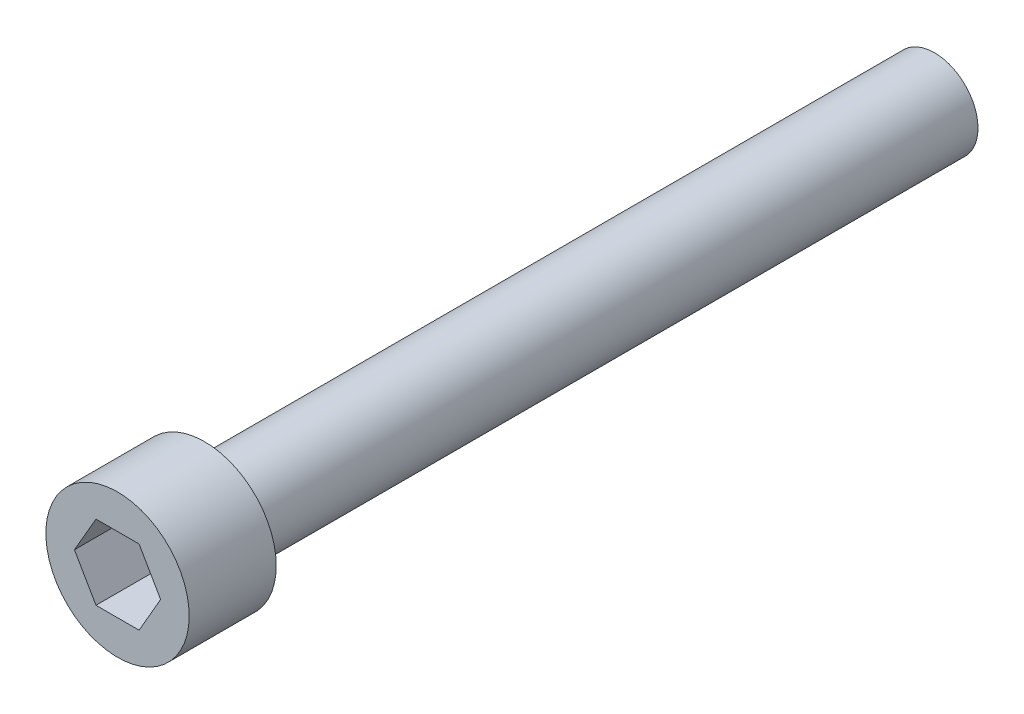
ISO-10303-21;
HEADER;
FILE_DESCRIPTION(('STEP AP214'),'2;1');
FILE_NAME('part.step','',(''),(''),'','','');
FILE_SCHEMA(('AUTOMOTIVE_DESIGN { 1 0 10303 214 1 1 1 1 }'));
ENDSEC;
DATA;
#1=APPLICATION_CONTEXT('core data for automotive mechanical design processes');
#2=APPLICATION_PROTOCOL_DEFINITION('international standard','automotive_design',2000,#1);
#3=PRODUCT_CONTEXT('',#1,'mechanical');
#4=PRODUCT('Part','Part','',(#3));
#5=PRODUCT_RELATED_PRODUCT_CATEGORY('part','',(#4));
#6=PRODUCT_DEFINITION_FORMATION('','',#4);
#7=PRODUCT_DEFINITION_CONTEXT('part definition',#1,'design');
#8=PRODUCT_DEFINITION('design','',#6,#7);
#9=PRODUCT_DEFINITION_SHAPE('','',#8);
#10=(LENGTH_UNIT() NAMED_UNIT(*) SI_UNIT(.MILLI.,.METRE.));
#11=(NAMED_UNIT(*) PLANE_ANGLE_UNIT() SI_UNIT($,.RADIAN.));
#12=(NAMED_UNIT(*) SI_UNIT($,.STERADIAN.) SOLID_ANGLE_UNIT());
#13=UNCERTAINTY_MEASURE_WITH_UNIT(LENGTH_MEASURE(1.E-05),#10,'distance_accuracy_value','');
#14=(GEOMETRIC_REPRESENTATION_CONTEXT(3) GLOBAL_UNCERTAINTY_ASSIGNED_CONTEXT((#13)) GLOBAL_UNIT_ASSIGNED_CONTEXT((#10,
#11,#12)) REPRESENTATION_CONTEXT('',''));
#15=CARTESIAN_POINT('',(0.,0.,0.));
#16=DIRECTION('',(0.,0.,1.));
#17=DIRECTION('',(1.,0.,0.));
#18=AXIS2_PLACEMENT_3D('',#15,#16,#17);
#19=CARTESIAN_POINT('',(3.42900000000001,0.,0.));
#20=DIRECTION('',(0.,0.,1.));
#21=DIRECTION('',(1.,0.,0.));
#22=AXIS2_PLACEMENT_3D('',#19,#20,#21);
#23=PLANE('',#22);
#24=DIRECTION('',(0.5,0.866025403784439,0.));
#25=VECTOR('',#24,1.);
#26=CARTESIAN_POINT('',(1.03111149638085,-1.7859375,0.));
#27=LINE('',#26,#25);
#28=CARTESIAN_POINT('',(1.03111149638085,-1.7859375,0.));
#29=VERTEX_POINT('',#28);
#30=CARTESIAN_POINT('',(2.06222299276169,0.,0.));
#31=VERTEX_POINT('',#30);
#32=EDGE_CURVE('E47',#29,#31,#27,.T.);
#33=ORIENTED_EDGE('',*,*,#32,.F.);
#34=DIRECTION('',(1.,0.,0.));
#35=VECTOR('',#34,1.);
#36=CARTESIAN_POINT('',(-1.03111149638085,-1.7859375,0.));
#37=LINE('',#36,#35);
#38=CARTESIAN_POINT('',(-1.03111149638085,-1.7859375,0.));
#39=VERTEX_POINT('',#38);
#40=EDGE_CURVE('E130',#39,#29,#37,.T.);
#41=ORIENTED_EDGE('',*,*,#40,.F.);
#42=DIRECTION('',(0.5,-0.866025403784439,0.));
#43=VECTOR('',#42,1.);
#44=CARTESIAN_POINT('',(-2.06222299276169,0.,0.));
#45=LINE('',#44,#43);
#46=CARTESIAN_POINT('',(-2.06222299276169,0.,0.));
#47=VERTEX_POINT('',#46);
#48=EDGE_CURVE('E128',#47,#39,#45,.T.);
#49=ORIENTED_EDGE('',*,*,#48,.F.);
#50=DIRECTION('',(-0.5,-0.866025403784439,0.));
#51=VECTOR('',#50,1.);
#52=CARTESIAN_POINT('',(-1.03111149638085,1.7859375,0.));
#53=LINE('',#52,#51);
#54=CARTESIAN_POINT('',(-1.03111149638085,1.7859375,0.));
#55=VERTEX_POINT('',#54);
#56=EDGE_CURVE('E95',#55,#47,#53,.T.);
#57=ORIENTED_EDGE('',*,*,#56,.F.);
#58=DIRECTION('',(-1.,0.,0.));
#59=VECTOR('',#58,1.);
#60=CARTESIAN_POINT('',(1.03111149638085,1.7859375,0.));
#61=LINE('',#60,#59);
#62=CARTESIAN_POINT('',(1.03111149638085,1.7859375,0.));
#63=VERTEX_POINT('',#62);
#64=EDGE_CURVE('E124',#63,#55,#61,.T.);
#65=ORIENTED_EDGE('',*,*,#64,.F.);
#66=DIRECTION('',(-0.5,0.866025403784438,0.));
#67=VECTOR('',#66,1.);
#68=CARTESIAN_POINT('',(2.06222299276169,0.,0.));
#69=LINE('',#68,#67);
#70=EDGE_CURVE('E121',#31,#63,#69,.T.);
#71=ORIENTED_EDGE('',*,*,#70,.F.);
#72=EDGE_LOOP('',(#33,#41,#49,#57,#65,#71));
#73=FACE_BOUND('',#72,.T.);
#74=CARTESIAN_POINT('',(0.,0.,0.));
#75=DIRECTION('',(0.,0.,1.));
#76=DIRECTION('',(1.,0.,0.));
#77=AXIS2_PLACEMENT_3D('',#74,#75,#76);
#78=CIRCLE('',#77,3.42900000000001);
#79=CARTESIAN_POINT('',(3.42900000000001,0.,0.));
#80=VERTEX_POINT('',#79);
#81=EDGE_CURVE('E134',#80,#80,#78,.T.);
#82=ORIENTED_EDGE('',*,*,#81,.T.);
#83=EDGE_LOOP('',(#82));
#84=FACE_BOUND('',#83,.T.);
#85=ADVANCED_FACE('F33',(#73,#84),#23,.T.);
#86=CARTESIAN_POINT('',(0.,0.,-39.0906));
#87=DIRECTION('',(0.,0.,-1.));
#88=DIRECTION('',(-1.,0.,0.));
#89=AXIS2_PLACEMENT_3D('',#86,#87,#88);
#90=PLANE('',#89);
#91=CARTESIAN_POINT('',(0.,0.,-39.0906));
#92=DIRECTION('',(0.,0.,1.));
#93=DIRECTION('',(1.,0.,0.));
#94=AXIS2_PLACEMENT_3D('',#91,#92,#93);
#95=CIRCLE('',#94,2.0828);
#96=CARTESIAN_POINT('',(2.08280000000001,0.,-39.0906));
#97=VERTEX_POINT('',#96);
#98=EDGE_CURVE('E11',#97,#97,#95,.T.);
#99=ORIENTED_EDGE('',*,*,#98,.F.);
#100=EDGE_LOOP('',(#99));
#101=FACE_BOUND('',#100,.T.);
#102=ADVANCED_FACE('F152',(#101),#90,.T.);
#103=CARTESIAN_POINT('',(0.,0.,0.));
#104=DIRECTION('',(0.,0.,1.));
#105=DIRECTION('',(1.,0.,0.));
#106=AXIS2_PLACEMENT_3D('',#103,#104,#105);
#107=CYLINDRICAL_SURFACE('',#106,2.0828);
#108=ORIENTED_EDGE('',*,*,#98,.T.);
#109=EDGE_LOOP('',(#108));
#110=FACE_BOUND('',#109,.T.);
#111=CARTESIAN_POINT('',(0.,0.,-4.1656));
#112=DIRECTION('',(0.,0.,1.));
#113=DIRECTION('',(1.,0.,0.));
#114=AXIS2_PLACEMENT_3D('',#111,#112,#113);
#115=CIRCLE('',#114,2.08280000000001);
#116=CARTESIAN_POINT('',(2.08280000000001,0.,-4.1656));
#117=VERTEX_POINT('',#116);
#118=EDGE_CURVE('E40',#117,#117,#115,.T.);
#119=ORIENTED_EDGE('',*,*,#118,.F.);
#120=EDGE_LOOP('',(#119));
#121=FACE_BOUND('',#120,.T.);
#122=ADVANCED_FACE('F150',(#110,#121),#107,.T.);
#123=CARTESIAN_POINT('',(2.08280000000001,0.,-4.1656));
#124=DIRECTION('',(0.,0.,-1.));
#125=DIRECTION('',(-1.,0.,0.));
#126=AXIS2_PLACEMENT_3D('',#123,#124,#125);
#127=PLANE('',#126);
#128=ORIENTED_EDGE('',*,*,#118,.T.);
#129=EDGE_LOOP('',(#128));
#130=FACE_BOUND('',#129,.T.);
#131=CARTESIAN_POINT('',(0.,0.,-4.1656));
#132=DIRECTION('',(0.,0.,1.));
#133=DIRECTION('',(1.,0.,0.));
#134=AXIS2_PLACEMENT_3D('',#131,#132,#133);
#135=CIRCLE('',#134,3.429);
#136=CARTESIAN_POINT('',(3.429,0.,-4.1656));
#137=VERTEX_POINT('',#136);
#138=EDGE_CURVE('E142',#137,#137,#135,.T.);
#139=ORIENTED_EDGE('',*,*,#138,.F.);
#140=EDGE_LOOP('',(#139));
#141=FACE_BOUND('',#140,.T.);
#142=ADVANCED_FACE('F147',(#130,#141),#127,.T.);
#143=CARTESIAN_POINT('',(0.,0.,0.));
#144=DIRECTION('',(0.,0.,1.));
#145=DIRECTION('',(1.,0.,0.));
#146=AXIS2_PLACEMENT_3D('',#143,#144,#145);
#147=CYLINDRICAL_SURFACE('',#146,3.429);
#148=ORIENTED_EDGE('',*,*,#138,.T.);
#149=EDGE_LOOP('',(#148));
#150=FACE_BOUND('',#149,.T.);
#151=ORIENTED_EDGE('',*,*,#81,.F.);
#152=EDGE_LOOP('',(#151));
#153=FACE_BOUND('',#152,.T.);
#154=ADVANCED_FACE('F159',(#150,#153),#147,.T.);
#155=CARTESIAN_POINT('',(1.03111149638085,-1.7859375,-3.175));
#156=DIRECTION('',(0.866025403784439,-0.5,0.));
#157=DIRECTION('',(0.5,0.866025403784439,0.));
#158=AXIS2_PLACEMENT_3D('',#155,#156,#157);
#159=PLANE('',#158);
#160=ORIENTED_EDGE('',*,*,#32,.T.);
#161=DIRECTION('',(0.,0.,1.));
#162=VECTOR('',#161,1.);
#163=CARTESIAN_POINT('',(2.06222299276169,0.,-3.175));
#164=LINE('',#163,#162);
#165=CARTESIAN_POINT('',(2.06222299276169,0.,-3.175));
#166=VERTEX_POINT('',#165);
#167=EDGE_CURVE('E77',#166,#31,#164,.T.);
#168=ORIENTED_EDGE('',*,*,#167,.F.);
#169=DIRECTION('',(0.5,0.866025403784439,0.));
#170=VECTOR('',#169,1.);
#171=CARTESIAN_POINT('',(1.03111149638085,-1.7859375,-3.175));
#172=LINE('',#171,#170);
#173=CARTESIAN_POINT('',(1.03111149638085,-1.7859375,-3.175));
#174=VERTEX_POINT('',#173);
#175=EDGE_CURVE('E132',#174,#166,#172,.T.);
#176=ORIENTED_EDGE('',*,*,#175,.F.);
#177=DIRECTION('',(0.,0.,1.));
#178=VECTOR('',#177,1.);
#179=CARTESIAN_POINT('',(1.03111149638085,-1.7859375,-3.175));
#180=LINE('',#179,#178);
#181=EDGE_CURVE('E55',#174,#29,#180,.T.);
#182=ORIENTED_EDGE('',*,*,#181,.T.);
#183=EDGE_LOOP('',(#160,#168,#176,#182));
#184=FACE_BOUND('',#183,.T.);
#185=ADVANCED_FACE('F172',(#184),#159,.F.);
#186=CARTESIAN_POINT('',(-1.03111149638085,-1.7859375,-3.175));
#187=DIRECTION('',(0.,-1.,0.));
#188=DIRECTION('',(1.,0.,0.));
#189=AXIS2_PLACEMENT_3D('',#186,#187,#188);
#190=PLANE('',#189);
#191=ORIENTED_EDGE('',*,*,#40,.T.);
#192=ORIENTED_EDGE('',*,*,#181,.F.);
#193=DIRECTION('',(1.,0.,0.));
#194=VECTOR('',#193,1.);
#195=CARTESIAN_POINT('',(-1.03111149638085,-1.7859375,-3.175));
#196=LINE('',#195,#194);
#197=CARTESIAN_POINT('',(-1.03111149638085,-1.7859375,-3.175));
#198=VERTEX_POINT('',#197);
#199=EDGE_CURVE('E107',#198,#174,#196,.T.);
#200=ORIENTED_EDGE('',*,*,#199,.F.);
#201=DIRECTION('',(0.,0.,1.));
#202=VECTOR('',#201,1.);
#203=CARTESIAN_POINT('',(-1.03111149638085,-1.7859375,-3.175));
#204=LINE('',#203,#202);
#205=EDGE_CURVE('E99',#198,#39,#204,.T.);
#206=ORIENTED_EDGE('',*,*,#205,.T.);
#207=EDGE_LOOP('',(#191,#192,#200,#206));
#208=FACE_BOUND('',#207,.T.);
#209=ADVANCED_FACE('F178',(#208),#190,.F.);
#210=CARTESIAN_POINT('',(-2.06222299276169,0.,-3.175));
#211=DIRECTION('',(-0.866025403784439,-0.5,0.));
#212=DIRECTION('',(0.5,-0.866025403784439,0.));
#213=AXIS2_PLACEMENT_3D('',#210,#211,#212);
#214=PLANE('',#213);
#215=ORIENTED_EDGE('',*,*,#48,.T.);
#216=ORIENTED_EDGE('',*,*,#205,.F.);
#217=DIRECTION('',(0.5,-0.866025403784439,0.));
#218=VECTOR('',#217,1.);
#219=CARTESIAN_POINT('',(-2.06222299276169,0.,-3.175));
#220=LINE('',#219,#218);
#221=CARTESIAN_POINT('',(-2.06222299276169,0.,-3.175));
#222=VERTEX_POINT('',#221);
#223=EDGE_CURVE('E103',#222,#198,#220,.T.);
#224=ORIENTED_EDGE('',*,*,#223,.F.);
#225=DIRECTION('',(0.,0.,1.));
#226=VECTOR('',#225,1.);
#227=CARTESIAN_POINT('',(-2.06222299276169,0.,-3.175));
#228=LINE('',#227,#226);
#229=EDGE_CURVE('E88',#222,#47,#228,.T.);
#230=ORIENTED_EDGE('',*,*,#229,.T.);
#231=EDGE_LOOP('',(#215,#216,#224,#230));
#232=FACE_BOUND('',#231,.T.);
#233=ADVANCED_FACE('F104',(#232),#214,.F.);
#234=CARTESIAN_POINT('',(-1.03111149638085,1.7859375,-3.175));
#235=DIRECTION('',(-0.866025403784439,0.5,0.));
#236=DIRECTION('',(-0.5,-0.866025403784439,0.));
#237=AXIS2_PLACEMENT_3D('',#234,#235,#236);
#238=PLANE('',#237);
#239=ORIENTED_EDGE('',*,*,#56,.T.);
#240=ORIENTED_EDGE('',*,*,#229,.F.);
#241=DIRECTION('',(-0.5,-0.866025403784439,0.));
#242=VECTOR('',#241,1.);
#243=CARTESIAN_POINT('',(-1.03111149638085,1.7859375,-3.175));
#244=LINE('',#243,#242);
#245=CARTESIAN_POINT('',(-1.03111149638085,1.7859375,-3.175));
#246=VERTEX_POINT('',#245);
#247=EDGE_CURVE('E92',#246,#222,#244,.T.);
#248=ORIENTED_EDGE('',*,*,#247,.F.);
#249=DIRECTION('',(0.,0.,1.));
#250=VECTOR('',#249,1.);
#251=CARTESIAN_POINT('',(-1.03111149638085,1.7859375,-3.175));
#252=LINE('',#251,#250);
#253=EDGE_CURVE('E100',#246,#55,#252,.T.);
#254=ORIENTED_EDGE('',*,*,#253,.T.);
#255=EDGE_LOOP('',(#239,#240,#248,#254));
#256=FACE_BOUND('',#255,.T.);
#257=ADVANCED_FACE('F90',(#256),#238,.F.);
#258=CARTESIAN_POINT('',(1.03111149638085,1.7859375,-3.175));
#259=DIRECTION('',(0.,1.,0.));
#260=DIRECTION('',(0.,0.,1.));
#261=AXIS2_PLACEMENT_3D('',#258,#259,#260);
#262=PLANE('',#261);
#263=ORIENTED_EDGE('',*,*,#64,.T.);
#264=ORIENTED_EDGE('',*,*,#253,.F.);
#265=DIRECTION('',(-1.,0.,0.));
#266=VECTOR('',#265,1.);
#267=CARTESIAN_POINT('',(1.03111149638085,1.7859375,-3.175));
#268=LINE('',#267,#266);
#269=CARTESIAN_POINT('',(1.03111149638085,1.7859375,-3.175));
#270=VERTEX_POINT('',#269);
#271=EDGE_CURVE('E113',#270,#246,#268,.T.);
#272=ORIENTED_EDGE('',*,*,#271,.F.);
#273=DIRECTION('',(0.,0.,1.));
#274=VECTOR('',#273,1.);
#275=CARTESIAN_POINT('',(1.03111149638085,1.7859375,-3.175));
#276=LINE('',#275,#274);
#277=EDGE_CURVE('E137',#270,#63,#276,.T.);
#278=ORIENTED_EDGE('',*,*,#277,.T.);
#279=EDGE_LOOP('',(#263,#264,#272,#278));
#280=FACE_BOUND('',#279,.T.);
#281=ADVANCED_FACE('F184',(#280),#262,.F.);
#282=CARTESIAN_POINT('',(2.06222299276169,0.,-3.175));
#283=DIRECTION('',(0.866025403784438,0.5,0.));
#284=DIRECTION('',(-0.5,0.866025403784439,0.));
#285=AXIS2_PLACEMENT_3D('',#282,#283,#284);
#286=PLANE('',#285);
#287=ORIENTED_EDGE('',*,*,#70,.T.);
#288=ORIENTED_EDGE('',*,*,#277,.F.);
#289=DIRECTION('',(-0.5,0.866025403784438,0.));
#290=VECTOR('',#289,1.);
#291=CARTESIAN_POINT('',(2.06222299276169,0.,-3.175));
#292=LINE('',#291,#290);
#293=EDGE_CURVE('E115',#166,#270,#292,.T.);
#294=ORIENTED_EDGE('',*,*,#293,.F.);
#295=ORIENTED_EDGE('',*,*,#167,.T.);
#296=EDGE_LOOP('',(#287,#288,#294,#295));
#297=FACE_BOUND('',#296,.T.);
#298=ADVANCED_FACE('F181',(#297),#286,.F.);
#299=CARTESIAN_POINT('',(0.,0.,-3.175));
#300=DIRECTION('',(0.,0.,1.));
#301=DIRECTION('',(1.,0.,0.));
#302=AXIS2_PLACEMENT_3D('',#299,#300,#301);
#303=PLANE('',#302);
#304=ORIENTED_EDGE('',*,*,#175,.T.);
#305=ORIENTED_EDGE('',*,*,#293,.T.);
#306=ORIENTED_EDGE('',*,*,#271,.T.);
#307=ORIENTED_EDGE('',*,*,#247,.T.);
#308=ORIENTED_EDGE('',*,*,#223,.T.);
#309=ORIENTED_EDGE('',*,*,#199,.T.);
#310=EDGE_LOOP('',(#304,#305,#306,#307,#308,#309));
#311=FACE_BOUND('',#310,.T.);
#312=ADVANCED_FACE('F110',(#311),#303,.T.);
#313=CLOSED_SHELL('',(#85,#102,#122,#142,#154,#185,#209,#233,#257,#281,#298,#312));
#314=MANIFOLD_SOLID_BREP('B2',#313);
#315=ADVANCED_BREP_SHAPE_REPRESENTATION('',(#18,#314),#14);
#316=SHAPE_DEFINITION_REPRESENTATION(#9,#315);
ENDSEC;
END-ISO-10303-21;
